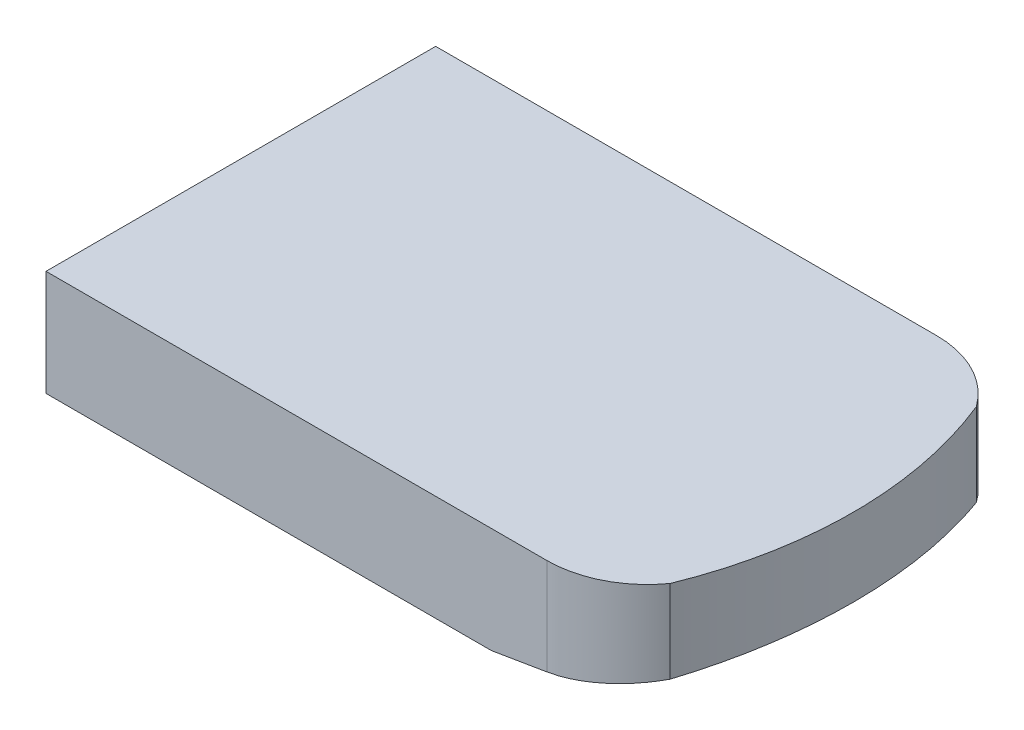
ISO-10303-21;
HEADER;
FILE_DESCRIPTION(('STEP AP214'),'2;1');
FILE_NAME('part.step','',(''),(''),'','','');
FILE_SCHEMA(('AUTOMOTIVE_DESIGN { 1 0 10303 214 1 1 1 1 }'));
ENDSEC;
DATA;
#1=APPLICATION_CONTEXT('core data for automotive mechanical design processes');
#2=APPLICATION_PROTOCOL_DEFINITION('international standard','automotive_design',2000,#1);
#3=PRODUCT_CONTEXT('',#1,'mechanical');
#4=PRODUCT('Part','Part','',(#3));
#5=PRODUCT_RELATED_PRODUCT_CATEGORY('part','',(#4));
#6=PRODUCT_DEFINITION_FORMATION('','',#4);
#7=PRODUCT_DEFINITION_CONTEXT('part definition',#1,'design');
#8=PRODUCT_DEFINITION('design','',#6,#7);
#9=PRODUCT_DEFINITION_SHAPE('','',#8);
#10=(LENGTH_UNIT() NAMED_UNIT(*) SI_UNIT(.MILLI.,.METRE.));
#11=(NAMED_UNIT(*) PLANE_ANGLE_UNIT() SI_UNIT($,.RADIAN.));
#12=(NAMED_UNIT(*) SI_UNIT($,.STERADIAN.) SOLID_ANGLE_UNIT());
#13=UNCERTAINTY_MEASURE_WITH_UNIT(LENGTH_MEASURE(1.E-05),#10,'distance_accuracy_value','');
#14=(GEOMETRIC_REPRESENTATION_CONTEXT(3) GLOBAL_UNCERTAINTY_ASSIGNED_CONTEXT((#13)) GLOBAL_UNIT_ASSIGNED_CONTEXT((#10,
#11,#12)) REPRESENTATION_CONTEXT('',''));
#15=CARTESIAN_POINT('',(0.,0.,0.));
#16=DIRECTION('',(0.,0.,1.));
#17=DIRECTION('',(1.,0.,0.));
#18=AXIS2_PLACEMENT_3D('',#15,#16,#17);
#19=CARTESIAN_POINT('',(0.,19.,0.));
#20=DIRECTION('',(1.,0.,0.));
#21=DIRECTION('',(0.,0.,-1.));
#22=AXIS2_PLACEMENT_3D('',#19,#20,#21);
#23=PLANE('',#22);
#24=DIRECTION('',(0.,0.,1.));
#25=VECTOR('',#24,1.);
#26=CARTESIAN_POINT('',(0.,0.,0.));
#27=LINE('',#26,#25);
#28=CARTESIAN_POINT('',(0.,0.,-70.));
#29=VERTEX_POINT('',#28);
#30=CARTESIAN_POINT('',(0.,0.,0.));
#31=VERTEX_POINT('',#30);
#32=EDGE_CURVE('E120',#29,#31,#27,.T.);
#33=ORIENTED_EDGE('',*,*,#32,.T.);
#34=DIRECTION('',(0.,-1.,0.));
#35=VECTOR('',#34,1.);
#36=CARTESIAN_POINT('',(0.,19.,0.));
#37=LINE('',#36,#35);
#38=CARTESIAN_POINT('',(0.,19.,0.));
#39=VERTEX_POINT('',#38);
#40=EDGE_CURVE('E11',#39,#31,#37,.T.);
#41=ORIENTED_EDGE('',*,*,#40,.F.);
#42=DIRECTION('',(0.,0.,1.));
#43=VECTOR('',#42,1.);
#44=CARTESIAN_POINT('',(0.,19.,0.));
#45=LINE('',#44,#43);
#46=CARTESIAN_POINT('',(0.,19.,-70.));
#47=VERTEX_POINT('',#46);
#48=EDGE_CURVE('E128',#47,#39,#45,.T.);
#49=ORIENTED_EDGE('',*,*,#48,.F.);
#50=DIRECTION('',(0.,-1.,0.));
#51=VECTOR('',#50,1.);
#52=CARTESIAN_POINT('',(0.,19.,-70.));
#53=LINE('',#52,#51);
#54=EDGE_CURVE('E116',#47,#29,#53,.T.);
#55=ORIENTED_EDGE('',*,*,#54,.T.);
#56=EDGE_LOOP('',(#33,#41,#49,#55));
#57=FACE_BOUND('',#56,.T.);
#58=ADVANCED_FACE('F33',(#57),#23,.F.);
#59=CARTESIAN_POINT('',(0.,19.,0.));
#60=DIRECTION('',(0.,0.,-1.));
#61=DIRECTION('',(-1.,0.,0.));
#62=AXIS2_PLACEMENT_3D('',#59,#60,#61);
#63=PLANE('',#62);
#64=DIRECTION('',(1.,0.,0.));
#65=VECTOR('',#64,1.);
#66=CARTESIAN_POINT('',(0.,0.,0.));
#67=LINE('',#66,#65);
#68=CARTESIAN_POINT('',(80.,0.,0.));
#69=VERTEX_POINT('',#68);
#70=EDGE_CURVE('E123',#31,#69,#67,.T.);
#71=ORIENTED_EDGE('',*,*,#70,.T.);
#72=DIRECTION('',(-0.986393923832144,-0.164398987305357,0.));
#73=VECTOR('',#72,1.);
#74=CARTESIAN_POINT('',(110.,5.,0.));
#75=LINE('',#74,#73);
#76=CARTESIAN_POINT('',(90.,1.66666666666666,0.));
#77=VERTEX_POINT('',#76);
#78=EDGE_CURVE('E47',#77,#69,#75,.T.);
#79=ORIENTED_EDGE('',*,*,#78,.F.);
#80=DIRECTION('',(0.,-1.,0.));
#81=VECTOR('',#80,1.);
#82=CARTESIAN_POINT('',(90.,19.,0.));
#83=LINE('',#82,#81);
#84=CARTESIAN_POINT('',(90.,19.,0.));
#85=VERTEX_POINT('',#84);
#86=EDGE_CURVE('E40',#85,#77,#83,.T.);
#87=ORIENTED_EDGE('',*,*,#86,.F.);
#88=DIRECTION('',(1.,0.,0.));
#89=VECTOR('',#88,1.);
#90=CARTESIAN_POINT('',(0.,19.,0.));
#91=LINE('',#90,#89);
#92=EDGE_CURVE('E79',#39,#85,#91,.T.);
#93=ORIENTED_EDGE('',*,*,#92,.F.);
#94=ORIENTED_EDGE('',*,*,#40,.T.);
#95=EDGE_LOOP('',(#71,#79,#87,#93,#94));
#96=FACE_BOUND('',#95,.T.);
#97=ADVANCED_FACE('F139',(#96),#63,.F.);
#98=CARTESIAN_POINT('',(90.,19.,-18.));
#99=DIRECTION('',(0.,-1.,0.));
#100=DIRECTION('',(0.,0.,-1.));
#101=AXIS2_PLACEMENT_3D('',#98,#99,#100);
#102=CYLINDRICAL_SURFACE('',#101,18.);
#103=ORIENTED_EDGE('',*,*,#86,.T.);
#104=CARTESIAN_POINT('',(90.,1.66666666666666,-18.));
#105=DIRECTION('',(-0.164398987305357,0.986393923832144,0.));
#106=DIRECTION('',(-0.986393923832144,-0.164398987305357,0.));
#107=AXIS2_PLACEMENT_3D('',#104,#105,#106);
#108=ELLIPSE('',#107,18.2482875908947,18.);
#109=CARTESIAN_POINT('',(104.62462042148,4.10410340357995,-7.50616954931912));
#110=VERTEX_POINT('',#109);
#111=EDGE_CURVE('E124',#77,#110,#108,.T.);
#112=ORIENTED_EDGE('',*,*,#111,.T.);
#113=DIRECTION('',(0.,-1.,0.));
#114=VECTOR('',#113,1.);
#115=CARTESIAN_POINT('',(104.62462042148,19.,-7.50616954931912));
#116=LINE('',#115,#114);
#117=CARTESIAN_POINT('',(104.62462042148,19.,-7.50616954931912));
#118=VERTEX_POINT('',#117);
#119=EDGE_CURVE('E110',#118,#110,#116,.T.);
#120=ORIENTED_EDGE('',*,*,#119,.F.);
#121=CARTESIAN_POINT('',(90.,19.,-18.));
#122=DIRECTION('',(0.,1.,0.));
#123=DIRECTION('',(0.,0.,1.));
#124=AXIS2_PLACEMENT_3D('',#121,#122,#123);
#125=CIRCLE('',#124,18.);
#126=EDGE_CURVE('E95',#85,#118,#125,.T.);
#127=ORIENTED_EDGE('',*,*,#126,.F.);
#128=EDGE_LOOP('',(#103,#112,#120,#127));
#129=FACE_BOUND('',#128,.T.);
#130=ADVANCED_FACE('F135',(#129),#102,.T.);
#131=CARTESIAN_POINT('',(37.,19.,-35.));
#132=DIRECTION('',(0.,-1.,0.));
#133=DIRECTION('',(0.,0.,-1.));
#134=AXIS2_PLACEMENT_3D('',#131,#132,#133);
#135=CYLINDRICAL_SURFACE('',#134,73.);
#136=ORIENTED_EDGE('',*,*,#119,.T.);
#137=CARTESIAN_POINT('',(37.,-7.16666666666668,-35.));
#138=DIRECTION('',(-0.164398987305357,0.986393923832144,0.));
#139=DIRECTION('',(-0.986393923832144,-0.164398987305357,0.));
#140=AXIS2_PLACEMENT_3D('',#137,#138,#139);
#141=ELLIPSE('',#140,74.0069441186284,73.);
#142=CARTESIAN_POINT('',(104.62462042148,4.10410340357995,-62.4938304506809));
#143=VERTEX_POINT('',#142);
#144=EDGE_CURVE('E106',#110,#143,#141,.T.);
#145=ORIENTED_EDGE('',*,*,#144,.T.);
#146=DIRECTION('',(0.,-1.,0.));
#147=VECTOR('',#146,1.);
#148=CARTESIAN_POINT('',(104.62462042148,19.,-62.4938304506809));
#149=LINE('',#148,#147);
#150=CARTESIAN_POINT('',(104.62462042148,19.,-62.4938304506809));
#151=VERTEX_POINT('',#150);
#152=EDGE_CURVE('E102',#151,#143,#149,.T.);
#153=ORIENTED_EDGE('',*,*,#152,.F.);
#154=CARTESIAN_POINT('',(37.,19.,-35.));
#155=DIRECTION('',(0.,1.,0.));
#156=DIRECTION('',(0.,0.,1.));
#157=AXIS2_PLACEMENT_3D('',#154,#155,#156);
#158=CIRCLE('',#157,73.);
#159=EDGE_CURVE('E88',#118,#151,#158,.T.);
#160=ORIENTED_EDGE('',*,*,#159,.F.);
#161=EDGE_LOOP('',(#136,#145,#153,#160));
#162=FACE_BOUND('',#161,.T.);
#163=ADVANCED_FACE('F103',(#162),#135,.T.);
#164=CARTESIAN_POINT('',(90.,19.,-52.));
#165=DIRECTION('',(0.,-1.,0.));
#166=DIRECTION('',(0.,0.,-1.));
#167=AXIS2_PLACEMENT_3D('',#164,#165,#166);
#168=CYLINDRICAL_SURFACE('',#167,18.);
#169=ORIENTED_EDGE('',*,*,#152,.T.);
#170=CARTESIAN_POINT('',(90.,1.66666666666666,-52.));
#171=DIRECTION('',(-0.164398987305357,0.986393923832144,0.));
#172=DIRECTION('',(-0.986393923832144,-0.164398987305357,0.));
#173=AXIS2_PLACEMENT_3D('',#170,#171,#172);
#174=ELLIPSE('',#173,18.2482875908947,18.);
#175=CARTESIAN_POINT('',(90.,1.66666666666666,-70.));
#176=VERTEX_POINT('',#175);
#177=EDGE_CURVE('E146',#143,#176,#174,.T.);
#178=ORIENTED_EDGE('',*,*,#177,.T.);
#179=DIRECTION('',(0.,-1.,0.));
#180=VECTOR('',#179,1.);
#181=CARTESIAN_POINT('',(90.,19.,-70.));
#182=LINE('',#181,#180);
#183=CARTESIAN_POINT('',(90.,19.,-70.));
#184=VERTEX_POINT('',#183);
#185=EDGE_CURVE('E111',#184,#176,#182,.T.);
#186=ORIENTED_EDGE('',*,*,#185,.F.);
#187=CARTESIAN_POINT('',(90.,19.,-52.));
#188=DIRECTION('',(0.,1.,0.));
#189=DIRECTION('',(0.,0.,1.));
#190=AXIS2_PLACEMENT_3D('',#187,#188,#189);
#191=CIRCLE('',#190,18.);
#192=EDGE_CURVE('E92',#151,#184,#191,.T.);
#193=ORIENTED_EDGE('',*,*,#192,.F.);
#194=EDGE_LOOP('',(#169,#178,#186,#193));
#195=FACE_BOUND('',#194,.T.);
#196=ADVANCED_FACE('F113',(#195),#168,.T.);
#197=CARTESIAN_POINT('',(0.,19.,-70.));
#198=DIRECTION('',(0.,0.,1.));
#199=DIRECTION('',(1.,0.,0.));
#200=AXIS2_PLACEMENT_3D('',#197,#198,#199);
#201=PLANE('',#200);
#202=ORIENTED_EDGE('',*,*,#185,.T.);
#203=DIRECTION('',(-0.986393923832144,-0.164398987305357,0.));
#204=VECTOR('',#203,1.);
#205=CARTESIAN_POINT('',(110.,5.,-70.));
#206=LINE('',#205,#204);
#207=CARTESIAN_POINT('',(80.,0.,-70.));
#208=VERTEX_POINT('',#207);
#209=EDGE_CURVE('E140',#176,#208,#206,.T.);
#210=ORIENTED_EDGE('',*,*,#209,.T.);
#211=DIRECTION('',(-1.,0.,0.));
#212=VECTOR('',#211,1.);
#213=CARTESIAN_POINT('',(0.,0.,-70.));
#214=LINE('',#213,#212);
#215=EDGE_CURVE('E71',#208,#29,#214,.T.);
#216=ORIENTED_EDGE('',*,*,#215,.T.);
#217=ORIENTED_EDGE('',*,*,#54,.F.);
#218=DIRECTION('',(-1.,0.,0.));
#219=VECTOR('',#218,1.);
#220=CARTESIAN_POINT('',(0.,19.,-70.));
#221=LINE('',#220,#219);
#222=EDGE_CURVE('E56',#184,#47,#221,.T.);
#223=ORIENTED_EDGE('',*,*,#222,.F.);
#224=EDGE_LOOP('',(#202,#210,#216,#217,#223));
#225=FACE_BOUND('',#224,.T.);
#226=ADVANCED_FACE('F160',(#225),#201,.F.);
#227=CARTESIAN_POINT('',(90.,19.,-52.));
#228=DIRECTION('',(0.,1.,0.));
#229=DIRECTION('',(0.,0.,1.));
#230=AXIS2_PLACEMENT_3D('',#227,#228,#229);
#231=PLANE('',#230);
#232=ORIENTED_EDGE('',*,*,#48,.T.);
#233=ORIENTED_EDGE('',*,*,#92,.T.);
#234=ORIENTED_EDGE('',*,*,#126,.T.);
#235=ORIENTED_EDGE('',*,*,#159,.T.);
#236=ORIENTED_EDGE('',*,*,#192,.T.);
#237=ORIENTED_EDGE('',*,*,#222,.T.);
#238=EDGE_LOOP('',(#232,#233,#234,#235,#236,#237));
#239=FACE_BOUND('',#238,.T.);
#240=ADVANCED_FACE('F90',(#239),#231,.T.);
#241=CARTESIAN_POINT('',(90.,0.,-52.));
#242=DIRECTION('',(0.,1.,0.));
#243=DIRECTION('',(0.,0.,1.));
#244=AXIS2_PLACEMENT_3D('',#241,#242,#243);
#245=PLANE('',#244);
#246=ORIENTED_EDGE('',*,*,#215,.F.);
#247=DIRECTION('',(0.,0.,1.));
#248=VECTOR('',#247,1.);
#249=CARTESIAN_POINT('',(80.,0.,-70.));
#250=LINE('',#249,#248);
#251=EDGE_CURVE('E142',#208,#69,#250,.T.);
#252=ORIENTED_EDGE('',*,*,#251,.T.);
#253=ORIENTED_EDGE('',*,*,#70,.F.);
#254=ORIENTED_EDGE('',*,*,#32,.F.);
#255=EDGE_LOOP('',(#246,#252,#253,#254));
#256=FACE_BOUND('',#255,.T.);
#257=ADVANCED_FACE('F156',(#256),#245,.F.);
#258=CARTESIAN_POINT('',(110.,5.,-70.));
#259=DIRECTION('',(-0.164398987305357,0.986393923832144,0.));
#260=DIRECTION('',(-0.986393923832144,-0.164398987305357,0.));
#261=AXIS2_PLACEMENT_3D('',#258,#259,#260);
#262=PLANE('',#261);
#263=ORIENTED_EDGE('',*,*,#78,.T.);
#264=ORIENTED_EDGE('',*,*,#251,.F.);
#265=ORIENTED_EDGE('',*,*,#209,.F.);
#266=ORIENTED_EDGE('',*,*,#177,.F.);
#267=ORIENTED_EDGE('',*,*,#144,.F.);
#268=ORIENTED_EDGE('',*,*,#111,.F.);
#269=EDGE_LOOP('',(#263,#264,#265,#266,#267,#268));
#270=FACE_BOUND('',#269,.T.);
#271=ADVANCED_FACE('F158',(#270),#262,.F.);
#272=CLOSED_SHELL('',(#58,#97,#130,#163,#196,#226,#240,#257,#271));
#273=MANIFOLD_SOLID_BREP('B2',#272);
#274=ADVANCED_BREP_SHAPE_REPRESENTATION('',(#18,#273),#14);
#275=SHAPE_DEFINITION_REPRESENTATION(#9,#274);
ENDSEC;
END-ISO-10303-21;
